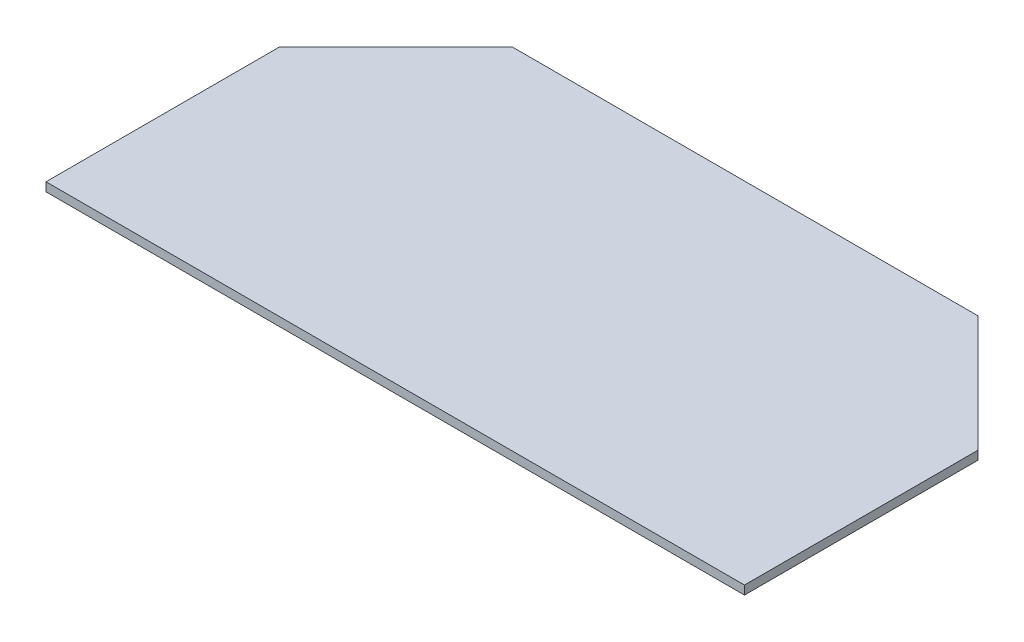
ISO-10303-21;
HEADER;
FILE_DESCRIPTION(('STEP AP214'),'2;1');
FILE_NAME('part.step','',(''),(''),'','','');
FILE_SCHEMA(('AUTOMOTIVE_DESIGN { 1 0 10303 214 1 1 1 1 }'));
ENDSEC;
DATA;
#1=APPLICATION_CONTEXT('core data for automotive mechanical design processes');
#2=APPLICATION_PROTOCOL_DEFINITION('international standard','automotive_design',2000,#1);
#3=PRODUCT_CONTEXT('',#1,'mechanical');
#4=PRODUCT('Part','Part','',(#3));
#5=PRODUCT_RELATED_PRODUCT_CATEGORY('part','',(#4));
#6=PRODUCT_DEFINITION_FORMATION('','',#4);
#7=PRODUCT_DEFINITION_CONTEXT('part definition',#1,'design');
#8=PRODUCT_DEFINITION('design','',#6,#7);
#9=PRODUCT_DEFINITION_SHAPE('','',#8);
#10=(LENGTH_UNIT() NAMED_UNIT(*) SI_UNIT(.MILLI.,.METRE.));
#11=(NAMED_UNIT(*) PLANE_ANGLE_UNIT() SI_UNIT($,.RADIAN.));
#12=(NAMED_UNIT(*) SI_UNIT($,.STERADIAN.) SOLID_ANGLE_UNIT());
#13=UNCERTAINTY_MEASURE_WITH_UNIT(LENGTH_MEASURE(1.E-05),#10,'distance_accuracy_value','');
#14=(GEOMETRIC_REPRESENTATION_CONTEXT(3) GLOBAL_UNCERTAINTY_ASSIGNED_CONTEXT((#13)) GLOBAL_UNIT_ASSIGNED_CONTEXT((#10,
#11,#12)) REPRESENTATION_CONTEXT('',''));
#15=CARTESIAN_POINT('',(0.,0.,0.));
#16=DIRECTION('',(0.,0.,1.));
#17=DIRECTION('',(1.,0.,0.));
#18=AXIS2_PLACEMENT_3D('',#15,#16,#17);
#19=CARTESIAN_POINT('',(-53.0421279222403,1.,-16.966864608076));
#20=DIRECTION('',(0.707106781186548,0.,0.707106781186547));
#21=DIRECTION('',(0.707106781186547,0.,-0.707106781186548));
#22=AXIS2_PLACEMENT_3D('',#19,#20,#21);
#23=PLANE('',#22);
#24=DIRECTION('',(-0.707106781186547,0.,0.707106781186548));
#25=VECTOR('',#24,1.);
#26=CARTESIAN_POINT('',(-53.0421279222403,0.,-16.966864608076));
#27=LINE('',#26,#25);
#28=CARTESIAN_POINT('',(-39.6921279222403,0.,-30.316864608076));
#29=VERTEX_POINT('',#28);
#30=CARTESIAN_POINT('',(-53.0421279222403,0.,-16.966864608076));
#31=VERTEX_POINT('',#30);
#32=EDGE_CURVE('E122',#29,#31,#27,.T.);
#33=ORIENTED_EDGE('',*,*,#32,.T.);
#34=DIRECTION('',(0.,-1.,0.));
#35=VECTOR('',#34,1.);
#36=CARTESIAN_POINT('',(-53.0421279222403,1.,-16.966864608076));
#37=LINE('',#36,#35);
#38=CARTESIAN_POINT('',(-53.0421279222403,1.,-16.966864608076));
#39=VERTEX_POINT('',#38);
#40=EDGE_CURVE('E11',#39,#31,#37,.T.);
#41=ORIENTED_EDGE('',*,*,#40,.F.);
#42=DIRECTION('',(-0.707106781186547,0.,0.707106781186548));
#43=VECTOR('',#42,1.);
#44=CARTESIAN_POINT('',(-53.0421279222403,1.,-16.966864608076));
#45=LINE('',#44,#43);
#46=CARTESIAN_POINT('',(-39.6921279222403,1.,-30.316864608076));
#47=VERTEX_POINT('',#46);
#48=EDGE_CURVE('E132',#47,#39,#45,.T.);
#49=ORIENTED_EDGE('',*,*,#48,.F.);
#50=DIRECTION('',(0.,-1.,0.));
#51=VECTOR('',#50,1.);
#52=CARTESIAN_POINT('',(-39.6921279222403,1.,-30.316864608076));
#53=LINE('',#52,#51);
#54=EDGE_CURVE('E118',#47,#29,#53,.T.);
#55=ORIENTED_EDGE('',*,*,#54,.T.);
#56=EDGE_LOOP('',(#33,#41,#49,#55));
#57=FACE_BOUND('',#56,.T.);
#58=ADVANCED_FACE('F38',(#57),#23,.F.);
#59=CARTESIAN_POINT('',(-53.0421279222403,1.,9.83313539192399));
#60=DIRECTION('',(1.,0.,0.));
#61=DIRECTION('',(0.,0.,-1.));
#62=AXIS2_PLACEMENT_3D('',#59,#60,#61);
#63=PLANE('',#62);
#64=DIRECTION('',(0.,0.,1.));
#65=VECTOR('',#64,1.);
#66=CARTESIAN_POINT('',(-53.0421279222403,0.,9.83313539192399));
#67=LINE('',#66,#65);
#68=CARTESIAN_POINT('',(-53.0421279222403,0.,9.83313539192399));
#69=VERTEX_POINT('',#68);
#70=EDGE_CURVE('E125',#31,#69,#67,.T.);
#71=ORIENTED_EDGE('',*,*,#70,.T.);
#72=DIRECTION('',(0.,-1.,0.));
#73=VECTOR('',#72,1.);
#74=CARTESIAN_POINT('',(-53.0421279222403,1.,9.83313539192399));
#75=LINE('',#74,#73);
#76=CARTESIAN_POINT('',(-53.0421279222403,1.,9.83313539192399));
#77=VERTEX_POINT('',#76);
#78=EDGE_CURVE('E46',#77,#69,#75,.T.);
#79=ORIENTED_EDGE('',*,*,#78,.F.);
#80=DIRECTION('',(0.,0.,1.));
#81=VECTOR('',#80,1.);
#82=CARTESIAN_POINT('',(-53.0421279222403,1.,9.83313539192399));
#83=LINE('',#82,#81);
#84=EDGE_CURVE('E91',#39,#77,#83,.T.);
#85=ORIENTED_EDGE('',*,*,#84,.F.);
#86=ORIENTED_EDGE('',*,*,#40,.T.);
#87=EDGE_LOOP('',(#71,#79,#85,#86));
#88=FACE_BOUND('',#87,.T.);
#89=ADVANCED_FACE('F156',(#88),#63,.F.);
#90=CARTESIAN_POINT('',(27.1078720777597,1.,9.83313539192398));
#91=DIRECTION('',(0.,0.,-1.));
#92=DIRECTION('',(-1.,0.,0.));
#93=AXIS2_PLACEMENT_3D('',#90,#91,#92);
#94=PLANE('',#93);
#95=DIRECTION('',(1.,0.,0.));
#96=VECTOR('',#95,1.);
#97=CARTESIAN_POINT('',(27.1078720777597,0.,9.83313539192398));
#98=LINE('',#97,#96);
#99=CARTESIAN_POINT('',(27.1078720777597,0.,9.83313539192398));
#100=VERTEX_POINT('',#99);
#101=EDGE_CURVE('E127',#69,#100,#98,.T.);
#102=ORIENTED_EDGE('',*,*,#101,.T.);
#103=DIRECTION('',(0.,-1.,0.));
#104=VECTOR('',#103,1.);
#105=CARTESIAN_POINT('',(27.1078720777597,1.,9.83313539192398));
#106=LINE('',#105,#104);
#107=CARTESIAN_POINT('',(27.1078720777597,1.,9.83313539192398));
#108=VERTEX_POINT('',#107);
#109=EDGE_CURVE('E113',#108,#100,#106,.T.);
#110=ORIENTED_EDGE('',*,*,#109,.F.);
#111=DIRECTION('',(1.,0.,0.));
#112=VECTOR('',#111,1.);
#113=CARTESIAN_POINT('',(27.1078720777597,1.,9.83313539192398));
#114=LINE('',#113,#112);
#115=EDGE_CURVE('E104',#77,#108,#114,.T.);
#116=ORIENTED_EDGE('',*,*,#115,.F.);
#117=ORIENTED_EDGE('',*,*,#78,.T.);
#118=EDGE_LOOP('',(#102,#110,#116,#117));
#119=FACE_BOUND('',#118,.T.);
#120=ADVANCED_FACE('F138',(#119),#94,.F.);
#121=CARTESIAN_POINT('',(27.1078720777597,1.,-16.966864608076));
#122=DIRECTION('',(-1.,0.,0.));
#123=DIRECTION('',(0.,0.,1.));
#124=AXIS2_PLACEMENT_3D('',#121,#122,#123);
#125=PLANE('',#124);
#126=DIRECTION('',(0.,0.,-1.));
#127=VECTOR('',#126,1.);
#128=CARTESIAN_POINT('',(27.1078720777597,0.,-16.966864608076));
#129=LINE('',#128,#127);
#130=CARTESIAN_POINT('',(27.1078720777597,0.,-16.966864608076));
#131=VERTEX_POINT('',#130);
#132=EDGE_CURVE('E112',#100,#131,#129,.T.);
#133=ORIENTED_EDGE('',*,*,#132,.T.);
#134=DIRECTION('',(0.,-1.,0.));
#135=VECTOR('',#134,1.);
#136=CARTESIAN_POINT('',(27.1078720777597,1.,-16.966864608076));
#137=LINE('',#136,#135);
#138=CARTESIAN_POINT('',(27.1078720777597,1.,-16.966864608076));
#139=VERTEX_POINT('',#138);
#140=EDGE_CURVE('E109',#139,#131,#137,.T.);
#141=ORIENTED_EDGE('',*,*,#140,.F.);
#142=DIRECTION('',(0.,0.,-1.));
#143=VECTOR('',#142,1.);
#144=CARTESIAN_POINT('',(27.1078720777597,1.,-16.966864608076));
#145=LINE('',#144,#143);
#146=EDGE_CURVE('E98',#108,#139,#145,.T.);
#147=ORIENTED_EDGE('',*,*,#146,.F.);
#148=ORIENTED_EDGE('',*,*,#109,.T.);
#149=EDGE_LOOP('',(#133,#141,#147,#148));
#150=FACE_BOUND('',#149,.T.);
#151=ADVANCED_FACE('F110',(#150),#125,.F.);
#152=CARTESIAN_POINT('',(13.7578720777597,1.,-30.316864608076));
#153=DIRECTION('',(-0.707106781186547,0.,0.707106781186548));
#154=DIRECTION('',(0.707106781186548,0.,0.707106781186547));
#155=AXIS2_PLACEMENT_3D('',#152,#153,#154);
#156=PLANE('',#155);
#157=DIRECTION('',(-0.707106781186548,0.,-0.707106781186547));
#158=VECTOR('',#157,1.);
#159=CARTESIAN_POINT('',(13.7578720777597,0.,-30.316864608076));
#160=LINE('',#159,#158);
#161=CARTESIAN_POINT('',(13.7578720777597,0.,-30.316864608076));
#162=VERTEX_POINT('',#161);
#163=EDGE_CURVE('E77',#131,#162,#160,.T.);
#164=ORIENTED_EDGE('',*,*,#163,.T.);
#165=DIRECTION('',(0.,-1.,0.));
#166=VECTOR('',#165,1.);
#167=CARTESIAN_POINT('',(13.7578720777597,1.,-30.316864608076));
#168=LINE('',#167,#166);
#169=CARTESIAN_POINT('',(13.7578720777597,1.,-30.316864608076));
#170=VERTEX_POINT('',#169);
#171=EDGE_CURVE('E114',#170,#162,#168,.T.);
#172=ORIENTED_EDGE('',*,*,#171,.F.);
#173=DIRECTION('',(-0.707106781186548,0.,-0.707106781186547));
#174=VECTOR('',#173,1.);
#175=CARTESIAN_POINT('',(13.7578720777597,1.,-30.316864608076));
#176=LINE('',#175,#174);
#177=EDGE_CURVE('E102',#139,#170,#176,.T.);
#178=ORIENTED_EDGE('',*,*,#177,.F.);
#179=ORIENTED_EDGE('',*,*,#140,.T.);
#180=EDGE_LOOP('',(#164,#172,#178,#179));
#181=FACE_BOUND('',#180,.T.);
#182=ADVANCED_FACE('F116',(#181),#156,.F.);
#183=CARTESIAN_POINT('',(-39.6921279222403,1.,-30.316864608076));
#184=DIRECTION('',(0.,0.,1.));
#185=DIRECTION('',(1.,0.,0.));
#186=AXIS2_PLACEMENT_3D('',#183,#184,#185);
#187=PLANE('',#186);
#188=DIRECTION('',(-1.,0.,0.));
#189=VECTOR('',#188,1.);
#190=CARTESIAN_POINT('',(-39.6921279222403,0.,-30.316864608076));
#191=LINE('',#190,#189);
#192=EDGE_CURVE('E83',#162,#29,#191,.T.);
#193=ORIENTED_EDGE('',*,*,#192,.T.);
#194=ORIENTED_EDGE('',*,*,#54,.F.);
#195=DIRECTION('',(-1.,0.,0.));
#196=VECTOR('',#195,1.);
#197=CARTESIAN_POINT('',(-39.6921279222403,1.,-30.316864608076));
#198=LINE('',#197,#196);
#199=EDGE_CURVE('E54',#170,#47,#198,.T.);
#200=ORIENTED_EDGE('',*,*,#199,.F.);
#201=ORIENTED_EDGE('',*,*,#171,.T.);
#202=EDGE_LOOP('',(#193,#194,#200,#201));
#203=FACE_BOUND('',#202,.T.);
#204=ADVANCED_FACE('F145',(#203),#187,.F.);
#205=CARTESIAN_POINT('',(0.,1.,0.));
#206=DIRECTION('',(0.,-1.,0.));
#207=DIRECTION('',(0.,0.,-1.));
#208=AXIS2_PLACEMENT_3D('',#205,#206,#207);
#209=PLANE('',#208);
#210=ORIENTED_EDGE('',*,*,#48,.T.);
#211=ORIENTED_EDGE('',*,*,#84,.T.);
#212=ORIENTED_EDGE('',*,*,#115,.T.);
#213=ORIENTED_EDGE('',*,*,#146,.T.);
#214=ORIENTED_EDGE('',*,*,#177,.T.);
#215=ORIENTED_EDGE('',*,*,#199,.T.);
#216=EDGE_LOOP('',(#210,#211,#212,#213,#214,#215));
#217=FACE_BOUND('',#216,.T.);
#218=ADVANCED_FACE('F100',(#217),#209,.F.);
#219=CARTESIAN_POINT('',(0.,0.,0.));
#220=DIRECTION('',(0.,-1.,0.));
#221=DIRECTION('',(0.,0.,-1.));
#222=AXIS2_PLACEMENT_3D('',#219,#220,#221);
#223=PLANE('',#222);
#224=ORIENTED_EDGE('',*,*,#32,.F.);
#225=ORIENTED_EDGE('',*,*,#192,.F.);
#226=ORIENTED_EDGE('',*,*,#163,.F.);
#227=ORIENTED_EDGE('',*,*,#132,.F.);
#228=ORIENTED_EDGE('',*,*,#101,.F.);
#229=ORIENTED_EDGE('',*,*,#70,.F.);
#230=EDGE_LOOP('',(#224,#225,#226,#227,#228,#229));
#231=FACE_BOUND('',#230,.T.);
#232=ADVANCED_FACE('F141',(#231),#223,.T.);
#233=CLOSED_SHELL('',(#58,#89,#120,#151,#182,#204,#218,#232));
#234=MANIFOLD_SOLID_BREP('B2',#233);
#235=ADVANCED_BREP_SHAPE_REPRESENTATION('',(#18,#234),#14);
#236=SHAPE_DEFINITION_REPRESENTATION(#9,#235);
ENDSEC;
END-ISO-10303-21;
